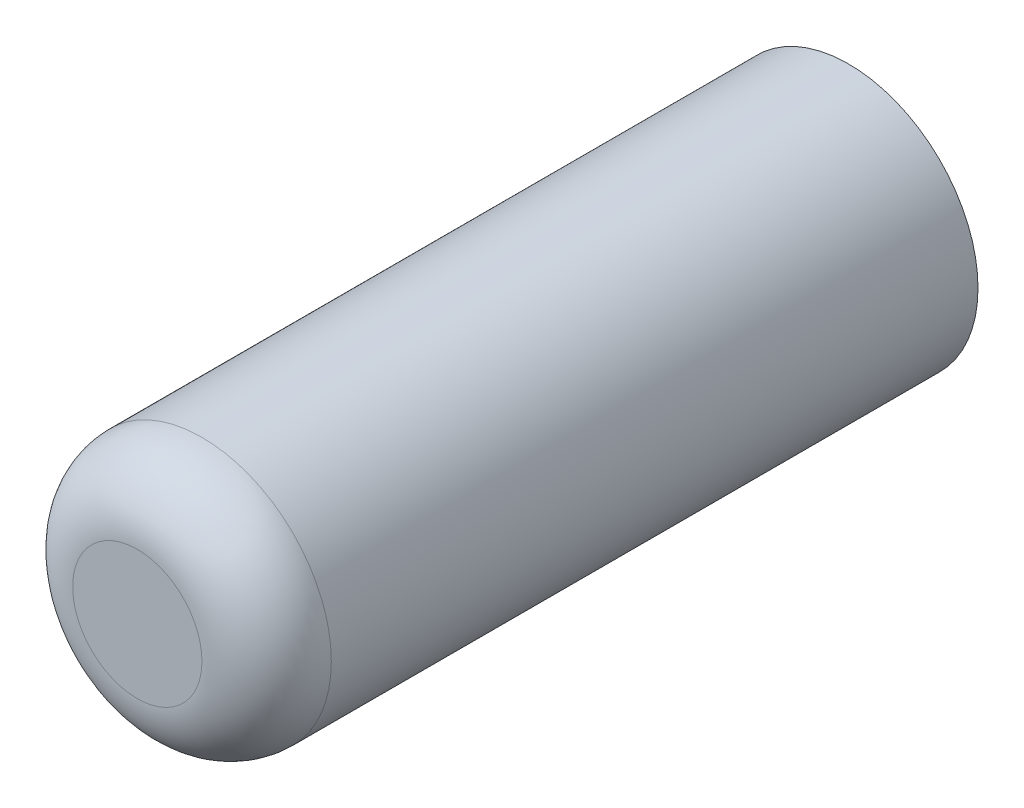
ISO-10303-21;
HEADER;
FILE_DESCRIPTION(('STEP AP214'),'2;1');
FILE_NAME('part.step','',(''),(''),'','','');
FILE_SCHEMA(('AUTOMOTIVE_DESIGN { 1 0 10303 214 1 1 1 1 }'));
ENDSEC;
DATA;
#1=APPLICATION_CONTEXT('core data for automotive mechanical design processes');
#2=APPLICATION_PROTOCOL_DEFINITION('international standard','automotive_design',2000,#1);
#3=PRODUCT_CONTEXT('',#1,'mechanical');
#4=PRODUCT('Part','Part','',(#3));
#5=PRODUCT_RELATED_PRODUCT_CATEGORY('part','',(#4));
#6=PRODUCT_DEFINITION_FORMATION('','',#4);
#7=PRODUCT_DEFINITION_CONTEXT('part definition',#1,'design');
#8=PRODUCT_DEFINITION('design','',#6,#7);
#9=PRODUCT_DEFINITION_SHAPE('','',#8);
#10=(LENGTH_UNIT() NAMED_UNIT(*) SI_UNIT(.MILLI.,.METRE.));
#11=(NAMED_UNIT(*) PLANE_ANGLE_UNIT() SI_UNIT($,.RADIAN.));
#12=(NAMED_UNIT(*) SI_UNIT($,.STERADIAN.) SOLID_ANGLE_UNIT());
#13=UNCERTAINTY_MEASURE_WITH_UNIT(LENGTH_MEASURE(1.E-05),#10,'distance_accuracy_value','');
#14=(GEOMETRIC_REPRESENTATION_CONTEXT(3) GLOBAL_UNCERTAINTY_ASSIGNED_CONTEXT((#13)) GLOBAL_UNIT_ASSIGNED_CONTEXT((#10,
#11,#12)) REPRESENTATION_CONTEXT('',''));
#15=CARTESIAN_POINT('',(0.,0.,0.));
#16=DIRECTION('',(0.,0.,1.));
#17=DIRECTION('',(1.,0.,0.));
#18=AXIS2_PLACEMENT_3D('',#15,#16,#17);
#19=CARTESIAN_POINT('',(0.,0.,22.));
#20=DIRECTION('',(0.,0.,-1.));
#21=DIRECTION('',(-1.,0.,0.));
#22=AXIS2_PLACEMENT_3D('',#19,#20,#21);
#23=CYLINDRICAL_SURFACE('',#22,4.);
#24=CARTESIAN_POINT('',(0.,0.,20.));
#25=DIRECTION('',(0.,0.,1.));
#26=DIRECTION('',(1.,0.,0.));
#27=AXIS2_PLACEMENT_3D('',#24,#25,#26);
#28=CIRCLE('',#27,4.);
#29=CARTESIAN_POINT('',(4.,0.,20.));
#30=VERTEX_POINT('',#29);
#31=EDGE_CURVE('E10',#30,#30,#28,.F.);
#32=ORIENTED_EDGE('',*,*,#31,.T.);
#33=EDGE_LOOP('',(#32));
#34=FACE_BOUND('',#33,.T.);
#35=CARTESIAN_POINT('',(0.,0.,0.));
#36=DIRECTION('',(0.,0.,1.));
#37=DIRECTION('',(1.,0.,0.));
#38=AXIS2_PLACEMENT_3D('',#35,#36,#37);
#39=CIRCLE('',#38,4.);
#40=CARTESIAN_POINT('',(4.,0.,0.));
#41=VERTEX_POINT('',#40);
#42=EDGE_CURVE('E48',#41,#41,#39,.T.);
#43=ORIENTED_EDGE('',*,*,#42,.T.);
#44=EDGE_LOOP('',(#43));
#45=FACE_BOUND('',#44,.T.);
#46=ADVANCED_FACE('F37',(#34,#45),#23,.T.);
#47=CARTESIAN_POINT('',(0.,0.,22.));
#48=DIRECTION('',(0.,0.,1.));
#49=DIRECTION('',(1.,0.,0.));
#50=AXIS2_PLACEMENT_3D('',#47,#48,#49);
#51=PLANE('',#50);
#52=CARTESIAN_POINT('',(0.,0.,22.));
#53=DIRECTION('',(0.,0.,1.));
#54=DIRECTION('',(1.,0.,0.));
#55=AXIS2_PLACEMENT_3D('',#52,#53,#54);
#56=CIRCLE('',#55,2.);
#57=CARTESIAN_POINT('',(2.,0.,22.));
#58=VERTEX_POINT('',#57);
#59=EDGE_CURVE('E44',#58,#58,#56,.T.);
#60=ORIENTED_EDGE('',*,*,#59,.T.);
#61=EDGE_LOOP('',(#60));
#62=FACE_BOUND('',#61,.T.);
#63=ADVANCED_FACE('F58',(#62),#51,.T.);
#64=CARTESIAN_POINT('',(0.,0.,0.));
#65=DIRECTION('',(0.,0.,1.));
#66=DIRECTION('',(1.,0.,0.));
#67=AXIS2_PLACEMENT_3D('',#64,#65,#66);
#68=PLANE('',#67);
#69=ORIENTED_EDGE('',*,*,#42,.F.);
#70=EDGE_LOOP('',(#69));
#71=FACE_BOUND('',#70,.T.);
#72=ADVANCED_FACE('F56',(#71),#68,.F.);
#73=CARTESIAN_POINT('',(0.,0.,20.));
#74=DIRECTION('',(0.,0.,1.));
#75=DIRECTION('',(1.,0.,0.));
#76=AXIS2_PLACEMENT_3D('',#73,#74,#75);
#77=DEGENERATE_TOROIDAL_SURFACE('',#76,2.,2.,.T.);
#78=ORIENTED_EDGE('',*,*,#31,.F.);
#79=EDGE_LOOP('',(#78));
#80=FACE_BOUND('',#79,.T.);
#81=ORIENTED_EDGE('',*,*,#59,.F.);
#82=EDGE_LOOP('',(#81));
#83=FACE_BOUND('',#82,.T.);
#84=ADVANCED_FACE('F39',(#80,#83),#77,.T.);
#85=CLOSED_SHELL('',(#46,#63,#72,#84));
#86=MANIFOLD_SOLID_BREP('B2',#85);
#87=ADVANCED_BREP_SHAPE_REPRESENTATION('',(#18,#86),#14);
#88=SHAPE_DEFINITION_REPRESENTATION(#9,#87);
ENDSEC;
END-ISO-10303-21;
